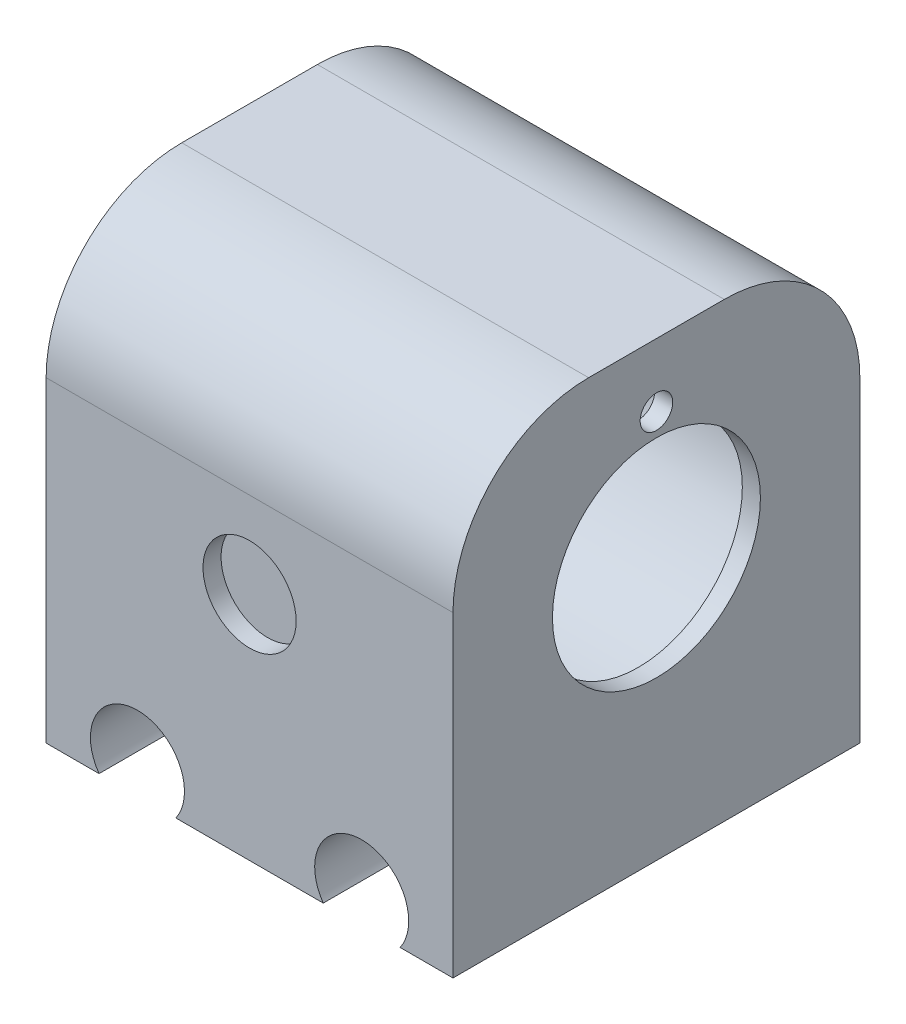
ISO-10303-21;
HEADER;
FILE_DESCRIPTION(('STEP AP214'),'2;1');
FILE_NAME('part.step','',(''),(''),'','','');
FILE_SCHEMA(('AUTOMOTIVE_DESIGN { 1 0 10303 214 1 1 1 1 }'));
ENDSEC;
DATA;
#1=APPLICATION_CONTEXT('core data for automotive mechanical design processes');
#2=APPLICATION_PROTOCOL_DEFINITION('international standard','automotive_design',2000,#1);
#3=PRODUCT_CONTEXT('',#1,'mechanical');
#4=PRODUCT('Part','Part','',(#3));
#5=PRODUCT_RELATED_PRODUCT_CATEGORY('part','',(#4));
#6=PRODUCT_DEFINITION_FORMATION('','',#4);
#7=PRODUCT_DEFINITION_CONTEXT('part definition',#1,'design');
#8=PRODUCT_DEFINITION('design','',#6,#7);
#9=PRODUCT_DEFINITION_SHAPE('','',#8);
#10=(LENGTH_UNIT() NAMED_UNIT(*) SI_UNIT(.MILLI.,.METRE.));
#11=(NAMED_UNIT(*) PLANE_ANGLE_UNIT() SI_UNIT($,.RADIAN.));
#12=(NAMED_UNIT(*) SI_UNIT($,.STERADIAN.) SOLID_ANGLE_UNIT());
#13=UNCERTAINTY_MEASURE_WITH_UNIT(LENGTH_MEASURE(1.E-05),#10,'distance_accuracy_value','');
#14=(GEOMETRIC_REPRESENTATION_CONTEXT(3) GLOBAL_UNCERTAINTY_ASSIGNED_CONTEXT((#13)) GLOBAL_UNIT_ASSIGNED_CONTEXT((#10,
#11,#12)) REPRESENTATION_CONTEXT('',''));
#15=CARTESIAN_POINT('',(0.,0.,0.));
#16=DIRECTION('',(0.,0.,1.));
#17=DIRECTION('',(1.,0.,0.));
#18=AXIS2_PLACEMENT_3D('',#15,#16,#17);
#19=CARTESIAN_POINT('',(30.7366071428572,1.09821428571429,22.5));
#20=DIRECTION('',(-1.,0.,0.));
#21=DIRECTION('',(0.,-1.,0.));
#22=AXIS2_PLACEMENT_3D('',#19,#20,#21);
#23=CYLINDRICAL_SURFACE('',#22,18.375);
#24=CARTESIAN_POINT('',(-14.2633928571429,1.09821428571429,22.5));
#25=DIRECTION('',(-1.,0.,0.));
#26=DIRECTION('',(0.,-1.,0.));
#27=AXIS2_PLACEMENT_3D('',#24,#25,#26);
#28=CIRCLE('',#27,18.375);
#29=CARTESIAN_POINT('',(-14.2633928571429,-17.2767857142857,22.5));
#30=VERTEX_POINT('',#29);
#31=EDGE_CURVE('E202',#30,#30,#28,.T.);
#32=ORIENTED_EDGE('',*,*,#31,.T.);
#33=EDGE_LOOP('',(#32));
#34=FACE_BOUND('',#33,.T.);
#35=CARTESIAN_POINT('',(28.7366071428571,1.09821428571429,22.5));
#36=DIRECTION('',(1.,0.,0.));
#37=DIRECTION('',(0.,1.,0.));
#38=AXIS2_PLACEMENT_3D('',#35,#36,#37);
#39=CIRCLE('',#38,18.375);
#40=CARTESIAN_POINT('',(28.7366071428571,19.4732142857143,22.5));
#41=VERTEX_POINT('',#40);
#42=EDGE_CURVE('E11',#41,#41,#39,.F.);
#43=ORIENTED_EDGE('',*,*,#42,.F.);
#44=EDGE_LOOP('',(#43));
#45=FACE_BOUND('',#44,.T.);
#46=ADVANCED_FACE('F39',(#34,#45),#23,.F.);
#47=CARTESIAN_POINT('',(-14.2633928571429,-27.9017857142857,45.));
#48=DIRECTION('',(0.,1.,0.));
#49=DIRECTION('',(0.,0.,1.));
#50=AXIS2_PLACEMENT_3D('',#47,#48,#49);
#51=PLANE('',#50);
#52=DIRECTION('',(1.,0.,0.));
#53=VECTOR('',#52,1.);
#54=CARTESIAN_POINT('',(-14.2633928571429,-27.9017857142857,0.));
#55=LINE('',#54,#53);
#56=CARTESIAN_POINT('',(-14.2633928571429,-27.9017857142857,0.));
#57=VERTEX_POINT('',#56);
#58=CARTESIAN_POINT('',(-8.41074497346191,-27.9017857142857,0.));
#59=VERTEX_POINT('',#58);
#60=EDGE_CURVE('E144',#57,#59,#55,.T.);
#61=ORIENTED_EDGE('',*,*,#60,.T.);
#62=DIRECTION('',(0.,0.,1.));
#63=VECTOR('',#62,1.);
#64=CARTESIAN_POINT('',(-8.41074497346191,-27.9017857142857,0.));
#65=LINE('',#64,#63);
#66=CARTESIAN_POINT('',(-8.41074497346191,-27.9017857142857,45.));
#67=VERTEX_POINT('',#66);
#68=EDGE_CURVE('E145',#59,#67,#65,.T.);
#69=ORIENTED_EDGE('',*,*,#68,.T.);
#70=DIRECTION('',(1.,0.,0.));
#71=VECTOR('',#70,1.);
#72=CARTESIAN_POINT('',(-14.2633928571429,-27.9017857142857,45.));
#73=LINE('',#72,#71);
#74=CARTESIAN_POINT('',(-14.2633928571429,-27.9017857142857,45.));
#75=VERTEX_POINT('',#74);
#76=EDGE_CURVE('E188',#75,#67,#73,.T.);
#77=ORIENTED_EDGE('',*,*,#76,.F.);
#78=DIRECTION('',(0.,0.,-1.));
#79=VECTOR('',#78,1.);
#80=CARTESIAN_POINT('',(-14.2633928571429,-27.9017857142857,45.));
#81=LINE('',#80,#79);
#82=EDGE_CURVE('E128',#75,#57,#81,.T.);
#83=ORIENTED_EDGE('',*,*,#82,.T.);
#84=EDGE_LOOP('',(#61,#69,#77,#83));
#85=FACE_BOUND('',#84,.T.);
#86=ADVANCED_FACE('F241',(#85),#51,.F.);
#87=CARTESIAN_POINT('',(0.0839592591762011,-27.9017857142857,45.));
#88=VERTEX_POINT('',#87);
#89=CARTESIAN_POINT('',(16.3892550265381,-27.9017857142857,45.));
#90=VERTEX_POINT('',#89);
#91=EDGE_CURVE('E232',#88,#90,#73,.T.);
#92=ORIENTED_EDGE('',*,*,#91,.F.);
#93=DIRECTION('',(0.,0.,1.));
#94=VECTOR('',#93,1.);
#95=CARTESIAN_POINT('',(0.0839592591762002,-27.9017857142857,0.));
#96=LINE('',#95,#94);
#97=CARTESIAN_POINT('',(0.0839592591762011,-27.9017857142857,0.));
#98=VERTEX_POINT('',#97);
#99=EDGE_CURVE('E227',#88,#98,#96,.F.);
#100=ORIENTED_EDGE('',*,*,#99,.T.);
#101=CARTESIAN_POINT('',(16.3892550265381,-27.9017857142857,0.));
#102=VERTEX_POINT('',#101);
#103=EDGE_CURVE('E141',#98,#102,#55,.T.);
#104=ORIENTED_EDGE('',*,*,#103,.T.);
#105=DIRECTION('',(0.,0.,1.));
#106=VECTOR('',#105,1.);
#107=CARTESIAN_POINT('',(16.3892550265381,-27.9017857142857,0.));
#108=LINE('',#107,#106);
#109=EDGE_CURVE('E123',#102,#90,#108,.T.);
#110=ORIENTED_EDGE('',*,*,#109,.T.);
#111=EDGE_LOOP('',(#92,#100,#104,#110));
#112=FACE_BOUND('',#111,.T.);
#113=ADVANCED_FACE('F238',(#112),#51,.F.);
#114=CARTESIAN_POINT('',(-14.2633928571429,22.0982142857143,45.));
#115=DIRECTION('',(1.,0.,0.));
#116=DIRECTION('',(0.,1.,0.));
#117=AXIS2_PLACEMENT_3D('',#114,#115,#116);
#118=PLANE('',#117);
#119=ORIENTED_EDGE('',*,*,#31,.F.);
#120=EDGE_LOOP('',(#119));
#121=FACE_BOUND('',#120,.T.);
#122=DIRECTION('',(0.,-1.,0.));
#123=VECTOR('',#122,1.);
#124=CARTESIAN_POINT('',(-14.2633928571429,22.0982142857143,45.));
#125=LINE('',#124,#123);
#126=CARTESIAN_POINT('',(-14.2633928571429,7.09821428571429,45.));
#127=VERTEX_POINT('',#126);
#128=EDGE_CURVE('E153',#127,#75,#125,.T.);
#129=ORIENTED_EDGE('',*,*,#128,.F.);
#130=CARTESIAN_POINT('',(-14.2633928571429,7.09821428571429,30.));
#131=DIRECTION('',(1.,0.,0.));
#132=DIRECTION('',(0.,1.,0.));
#133=AXIS2_PLACEMENT_3D('',#130,#131,#132);
#134=CIRCLE('',#133,15.);
#135=CARTESIAN_POINT('',(-14.2633928571429,22.0982142857143,30.));
#136=VERTEX_POINT('',#135);
#137=EDGE_CURVE('E167',#127,#136,#134,.F.);
#138=ORIENTED_EDGE('',*,*,#137,.T.);
#139=DIRECTION('',(0.,0.,-1.));
#140=VECTOR('',#139,1.);
#141=CARTESIAN_POINT('',(-14.2633928571429,22.0982142857143,0.));
#142=LINE('',#141,#140);
#143=CARTESIAN_POINT('',(-14.2633928571429,22.0982142857143,15.));
#144=VERTEX_POINT('',#143);
#145=EDGE_CURVE('E195',#136,#144,#142,.T.);
#146=ORIENTED_EDGE('',*,*,#145,.T.);
#147=CARTESIAN_POINT('',(-14.2633928571429,7.09821428571429,15.));
#148=DIRECTION('',(1.,0.,0.));
#149=DIRECTION('',(0.,1.,0.));
#150=AXIS2_PLACEMENT_3D('',#147,#148,#149);
#151=CIRCLE('',#150,15.);
#152=CARTESIAN_POINT('',(-14.2633928571429,7.09821428571429,0.));
#153=VERTEX_POINT('',#152);
#154=EDGE_CURVE('E165',#144,#153,#151,.F.);
#155=ORIENTED_EDGE('',*,*,#154,.T.);
#156=DIRECTION('',(0.,-1.,0.));
#157=VECTOR('',#156,1.);
#158=CARTESIAN_POINT('',(-14.2633928571429,22.0982142857143,0.));
#159=LINE('',#158,#157);
#160=EDGE_CURVE('E142',#153,#57,#159,.T.);
#161=ORIENTED_EDGE('',*,*,#160,.T.);
#162=ORIENTED_EDGE('',*,*,#82,.F.);
#163=EDGE_LOOP('',(#129,#138,#146,#155,#161,#162));
#164=FACE_BOUND('',#163,.T.);
#165=ADVANCED_FACE('F194',(#121,#164),#118,.F.);
#166=CARTESIAN_POINT('',(24.8839592591762,-27.9017857142857,45.));
#167=VERTEX_POINT('',#166);
#168=CARTESIAN_POINT('',(30.7366071428571,-27.9017857142857,45.));
#169=VERTEX_POINT('',#168);
#170=EDGE_CURVE('E136',#167,#169,#73,.T.);
#171=ORIENTED_EDGE('',*,*,#170,.F.);
#172=DIRECTION('',(0.,0.,1.));
#173=VECTOR('',#172,1.);
#174=CARTESIAN_POINT('',(24.8839592591762,-27.9017857142857,0.));
#175=LINE('',#174,#173);
#176=CARTESIAN_POINT('',(24.8839592591762,-27.9017857142857,0.));
#177=VERTEX_POINT('',#176);
#178=EDGE_CURVE('E120',#167,#177,#175,.F.);
#179=ORIENTED_EDGE('',*,*,#178,.T.);
#180=CARTESIAN_POINT('',(30.7366071428571,-27.9017857142857,0.));
#181=VERTEX_POINT('',#180);
#182=EDGE_CURVE('E134',#177,#181,#55,.T.);
#183=ORIENTED_EDGE('',*,*,#182,.T.);
#184=DIRECTION('',(0.,0.,-1.));
#185=VECTOR('',#184,1.);
#186=CARTESIAN_POINT('',(30.7366071428571,-27.9017857142857,45.));
#187=LINE('',#186,#185);
#188=EDGE_CURVE('E156',#169,#181,#187,.T.);
#189=ORIENTED_EDGE('',*,*,#188,.F.);
#190=EDGE_LOOP('',(#171,#179,#183,#189));
#191=FACE_BOUND('',#190,.T.);
#192=ADVANCED_FACE('F132',(#191),#51,.F.);
#193=CARTESIAN_POINT('',(30.7366071428571,22.0982142857143,45.));
#194=DIRECTION('',(-1.,0.,0.));
#195=DIRECTION('',(0.,-1.,0.));
#196=AXIS2_PLACEMENT_3D('',#193,#194,#195);
#197=PLANE('',#196);
#198=CARTESIAN_POINT('',(30.7366071428571,15.0982142857143,22.5));
#199=DIRECTION('',(1.,0.,0.));
#200=DIRECTION('',(0.,1.,0.));
#201=AXIS2_PLACEMENT_3D('',#198,#199,#200);
#202=CIRCLE('',#201,1.8);
#203=CARTESIAN_POINT('',(30.7366071428571,16.8982142857143,22.5));
#204=VERTEX_POINT('',#203);
#205=EDGE_CURVE('E428',#204,#204,#202,.T.);
#206=ORIENTED_EDGE('',*,*,#205,.F.);
#207=EDGE_LOOP('',(#206));
#208=FACE_BOUND('',#207,.T.);
#209=CARTESIAN_POINT('',(30.7366071428571,1.09821428571429,22.5));
#210=DIRECTION('',(1.,0.,0.));
#211=DIRECTION('',(0.,1.,0.));
#212=AXIS2_PLACEMENT_3D('',#209,#210,#211);
#213=CIRCLE('',#212,11.5);
#214=CARTESIAN_POINT('',(30.7366071428571,12.5982142857143,22.5));
#215=VERTEX_POINT('',#214);
#216=EDGE_CURVE('E205',#215,#215,#213,.T.);
#217=ORIENTED_EDGE('',*,*,#216,.F.);
#218=EDGE_LOOP('',(#217));
#219=FACE_BOUND('',#218,.T.);
#220=DIRECTION('',(0.,0.,-1.));
#221=VECTOR('',#220,1.);
#222=CARTESIAN_POINT('',(30.7366071428571,22.0982142857143,0.));
#223=LINE('',#222,#221);
#224=CARTESIAN_POINT('',(30.7366071428571,22.0982142857143,30.));
#225=VERTEX_POINT('',#224);
#226=CARTESIAN_POINT('',(30.7366071428571,22.0982142857143,15.));
#227=VERTEX_POINT('',#226);
#228=EDGE_CURVE('E180',#225,#227,#223,.T.);
#229=ORIENTED_EDGE('',*,*,#228,.F.);
#230=CARTESIAN_POINT('',(30.7366071428571,7.0982142857143,30.));
#231=DIRECTION('',(-1.,0.,0.));
#232=DIRECTION('',(0.,-1.,0.));
#233=AXIS2_PLACEMENT_3D('',#230,#231,#232);
#234=CIRCLE('',#233,15.);
#235=CARTESIAN_POINT('',(30.7366071428571,7.09821428571429,45.));
#236=VERTEX_POINT('',#235);
#237=EDGE_CURVE('E175',#225,#236,#234,.F.);
#238=ORIENTED_EDGE('',*,*,#237,.T.);
#239=DIRECTION('',(0.,1.,0.));
#240=VECTOR('',#239,1.);
#241=CARTESIAN_POINT('',(30.7366071428571,22.0982142857143,45.));
#242=LINE('',#241,#240);
#243=EDGE_CURVE('E158',#169,#236,#242,.T.);
#244=ORIENTED_EDGE('',*,*,#243,.F.);
#245=ORIENTED_EDGE('',*,*,#188,.T.);
#246=DIRECTION('',(0.,1.,0.));
#247=VECTOR('',#246,1.);
#248=CARTESIAN_POINT('',(30.7366071428571,22.0982142857143,0.));
#249=LINE('',#248,#247);
#250=CARTESIAN_POINT('',(30.7366071428571,7.0982142857143,0.));
#251=VERTEX_POINT('',#250);
#252=EDGE_CURVE('E140',#181,#251,#249,.T.);
#253=ORIENTED_EDGE('',*,*,#252,.T.);
#254=CARTESIAN_POINT('',(30.7366071428571,7.0982142857143,15.));
#255=DIRECTION('',(-1.,0.,0.));
#256=DIRECTION('',(0.,-1.,0.));
#257=AXIS2_PLACEMENT_3D('',#254,#255,#256);
#258=CIRCLE('',#257,15.);
#259=EDGE_CURVE('E60',#251,#227,#258,.F.);
#260=ORIENTED_EDGE('',*,*,#259,.T.);
#261=EDGE_LOOP('',(#229,#238,#244,#245,#253,#260));
#262=FACE_BOUND('',#261,.T.);
#263=ADVANCED_FACE('F179',(#208,#219,#262),#197,.F.);
#264=CARTESIAN_POINT('',(0.,0.,45.));
#265=DIRECTION('',(0.,0.,1.));
#266=DIRECTION('',(1.,0.,0.));
#267=AXIS2_PLACEMENT_3D('',#264,#265,#266);
#268=PLANE('',#267);
#269=ORIENTED_EDGE('',*,*,#243,.T.);
#270=DIRECTION('',(-1.,0.,0.));
#271=VECTOR('',#270,1.);
#272=CARTESIAN_POINT('',(0.,7.09821428571429,45.));
#273=LINE('',#272,#271);
#274=EDGE_CURVE('E162',#236,#127,#273,.T.);
#275=ORIENTED_EDGE('',*,*,#274,.T.);
#276=ORIENTED_EDGE('',*,*,#128,.T.);
#277=ORIENTED_EDGE('',*,*,#76,.T.);
#278=CARTESIAN_POINT('',(-4.16339285714286,-24.9017857142857,45.));
#279=DIRECTION('',(0.,0.,1.));
#280=DIRECTION('',(1.,0.,0.));
#281=AXIS2_PLACEMENT_3D('',#278,#279,#280);
#282=CIRCLE('',#281,5.2);
#283=EDGE_CURVE('E137',#88,#67,#282,.T.);
#284=ORIENTED_EDGE('',*,*,#283,.F.);
#285=ORIENTED_EDGE('',*,*,#91,.T.);
#286=CARTESIAN_POINT('',(20.6366071428571,-24.9017857142857,45.));
#287=DIRECTION('',(0.,0.,1.));
#288=DIRECTION('',(1.,0.,0.));
#289=AXIS2_PLACEMENT_3D('',#286,#287,#288);
#290=CIRCLE('',#289,5.2);
#291=EDGE_CURVE('E221',#167,#90,#290,.T.);
#292=ORIENTED_EDGE('',*,*,#291,.F.);
#293=ORIENTED_EDGE('',*,*,#170,.T.);
#294=EDGE_LOOP('',(#269,#275,#276,#277,#284,#285,#292,#293));
#295=FACE_BOUND('',#294,.T.);
#296=CARTESIAN_POINT('',(8.23660714285715,-2.40178571428571,45.));
#297=DIRECTION('',(0.,0.,1.));
#298=DIRECTION('',(1.,0.,0.));
#299=AXIS2_PLACEMENT_3D('',#296,#297,#298);
#300=CIRCLE('',#299,5.15);
#301=CARTESIAN_POINT('',(13.3866071428572,-2.40178571428571,45.));
#302=VERTEX_POINT('',#301);
#303=EDGE_CURVE('E215',#302,#302,#300,.T.);
#304=ORIENTED_EDGE('',*,*,#303,.F.);
#305=EDGE_LOOP('',(#304));
#306=FACE_BOUND('',#305,.T.);
#307=ADVANCED_FACE('F185',(#295,#306),#268,.T.);
#308=CARTESIAN_POINT('',(0.,0.,0.));
#309=DIRECTION('',(0.,0.,1.));
#310=DIRECTION('',(1.,0.,0.));
#311=AXIS2_PLACEMENT_3D('',#308,#309,#310);
#312=PLANE('',#311);
#313=CARTESIAN_POINT('',(8.23660714285714,-2.40178571428571,0.));
#314=DIRECTION('',(0.,0.,-1.));
#315=DIRECTION('',(-1.,0.,0.));
#316=AXIS2_PLACEMENT_3D('',#313,#314,#315);
#317=CIRCLE('',#316,5.15);
#318=CARTESIAN_POINT('',(3.08660714285714,-2.40178571428571,0.));
#319=VERTEX_POINT('',#318);
#320=EDGE_CURVE('E211',#319,#319,#317,.T.);
#321=ORIENTED_EDGE('',*,*,#320,.F.);
#322=EDGE_LOOP('',(#321));
#323=FACE_BOUND('',#322,.T.);
#324=ORIENTED_EDGE('',*,*,#160,.F.);
#325=DIRECTION('',(-1.,0.,0.));
#326=VECTOR('',#325,1.);
#327=CARTESIAN_POINT('',(30.7366071428571,7.0982142857143,0.));
#328=LINE('',#327,#326);
#329=EDGE_CURVE('E47',#153,#251,#328,.F.);
#330=ORIENTED_EDGE('',*,*,#329,.T.);
#331=ORIENTED_EDGE('',*,*,#252,.F.);
#332=ORIENTED_EDGE('',*,*,#182,.F.);
#333=CARTESIAN_POINT('',(20.6366071428571,-24.9017857142857,0.));
#334=DIRECTION('',(0.,0.,1.));
#335=DIRECTION('',(1.,0.,0.));
#336=AXIS2_PLACEMENT_3D('',#333,#334,#335);
#337=CIRCLE('',#336,5.2);
#338=EDGE_CURVE('E117',#177,#102,#337,.T.);
#339=ORIENTED_EDGE('',*,*,#338,.T.);
#340=ORIENTED_EDGE('',*,*,#103,.F.);
#341=CARTESIAN_POINT('',(-4.16339285714286,-24.9017857142857,0.));
#342=DIRECTION('',(0.,0.,1.));
#343=DIRECTION('',(1.,0.,0.));
#344=AXIS2_PLACEMENT_3D('',#341,#342,#343);
#345=CIRCLE('',#344,5.2);
#346=EDGE_CURVE('E127',#98,#59,#345,.T.);
#347=ORIENTED_EDGE('',*,*,#346,.T.);
#348=ORIENTED_EDGE('',*,*,#60,.F.);
#349=EDGE_LOOP('',(#324,#330,#331,#332,#339,#340,#347,#348));
#350=FACE_BOUND('',#349,.T.);
#351=ADVANCED_FACE('F139',(#323,#350),#312,.F.);
#352=CARTESIAN_POINT('',(20.6366071428571,-24.9017857142857,0.));
#353=DIRECTION('',(0.,0.,1.));
#354=DIRECTION('',(1.,0.,0.));
#355=AXIS2_PLACEMENT_3D('',#352,#353,#354);
#356=CYLINDRICAL_SURFACE('',#355,5.2);
#357=ORIENTED_EDGE('',*,*,#338,.F.);
#358=ORIENTED_EDGE('',*,*,#178,.F.);
#359=ORIENTED_EDGE('',*,*,#291,.T.);
#360=ORIENTED_EDGE('',*,*,#109,.F.);
#361=EDGE_LOOP('',(#357,#358,#359,#360));
#362=FACE_BOUND('',#361,.T.);
#363=ADVANCED_FACE('F119',(#362),#356,.F.);
#364=CARTESIAN_POINT('',(-4.16339285714286,-24.9017857142857,0.));
#365=DIRECTION('',(0.,0.,1.));
#366=DIRECTION('',(1.,0.,0.));
#367=AXIS2_PLACEMENT_3D('',#364,#365,#366);
#368=CYLINDRICAL_SURFACE('',#367,5.2);
#369=ORIENTED_EDGE('',*,*,#346,.F.);
#370=ORIENTED_EDGE('',*,*,#99,.F.);
#371=ORIENTED_EDGE('',*,*,#283,.T.);
#372=ORIENTED_EDGE('',*,*,#68,.F.);
#373=EDGE_LOOP('',(#369,#370,#371,#372));
#374=FACE_BOUND('',#373,.T.);
#375=ADVANCED_FACE('F240',(#374),#368,.F.);
#376=CARTESIAN_POINT('',(8.23660714285715,-2.40178571428571,43.));
#377=DIRECTION('',(0.,0.,1.));
#378=DIRECTION('',(1.,0.,0.));
#379=AXIS2_PLACEMENT_3D('',#376,#377,#378);
#380=CYLINDRICAL_SURFACE('',#379,5.15);
#381=CARTESIAN_POINT('',(8.23660714285715,-2.40178571428571,43.));
#382=DIRECTION('',(0.,0.,1.));
#383=DIRECTION('',(1.,0.,0.));
#384=AXIS2_PLACEMENT_3D('',#381,#382,#383);
#385=CIRCLE('',#384,5.15);
#386=CARTESIAN_POINT('',(13.3866071428572,-2.40178571428571,43.));
#387=VERTEX_POINT('',#386);
#388=EDGE_CURVE('E218',#387,#387,#385,.T.);
#389=ORIENTED_EDGE('',*,*,#388,.F.);
#390=EDGE_LOOP('',(#389));
#391=FACE_BOUND('',#390,.T.);
#392=ORIENTED_EDGE('',*,*,#303,.T.);
#393=EDGE_LOOP('',(#392));
#394=FACE_BOUND('',#393,.T.);
#395=ADVANCED_FACE('F274',(#391,#394),#380,.F.);
#396=CARTESIAN_POINT('',(8.23660714285715,-2.40178571428571,43.));
#397=DIRECTION('',(0.,0.,1.));
#398=DIRECTION('',(1.,0.,0.));
#399=AXIS2_PLACEMENT_3D('',#396,#397,#398);
#400=PLANE('',#399);
#401=ORIENTED_EDGE('',*,*,#388,.T.);
#402=EDGE_LOOP('',(#401));
#403=FACE_BOUND('',#402,.T.);
#404=ADVANCED_FACE('F270',(#403),#400,.T.);
#405=CARTESIAN_POINT('',(8.23660714285714,-2.40178571428571,2.));
#406=DIRECTION('',(0.,0.,-1.));
#407=DIRECTION('',(-1.,0.,0.));
#408=AXIS2_PLACEMENT_3D('',#405,#406,#407);
#409=CYLINDRICAL_SURFACE('',#408,5.15);
#410=CARTESIAN_POINT('',(8.23660714285714,-2.40178571428571,2.));
#411=DIRECTION('',(0.,0.,-1.));
#412=DIRECTION('',(-1.,0.,0.));
#413=AXIS2_PLACEMENT_3D('',#410,#411,#412);
#414=CIRCLE('',#413,5.15);
#415=CARTESIAN_POINT('',(3.08660714285714,-2.40178571428571,2.));
#416=VERTEX_POINT('',#415);
#417=EDGE_CURVE('E212',#416,#416,#414,.T.);
#418=ORIENTED_EDGE('',*,*,#417,.F.);
#419=EDGE_LOOP('',(#418));
#420=FACE_BOUND('',#419,.T.);
#421=ORIENTED_EDGE('',*,*,#320,.T.);
#422=EDGE_LOOP('',(#421));
#423=FACE_BOUND('',#422,.T.);
#424=ADVANCED_FACE('F266',(#420,#423),#409,.F.);
#425=CARTESIAN_POINT('',(8.23660714285714,-2.40178571428571,2.));
#426=DIRECTION('',(0.,0.,-1.));
#427=DIRECTION('',(-1.,0.,0.));
#428=AXIS2_PLACEMENT_3D('',#425,#426,#427);
#429=PLANE('',#428);
#430=ORIENTED_EDGE('',*,*,#417,.T.);
#431=EDGE_LOOP('',(#430));
#432=FACE_BOUND('',#431,.T.);
#433=ADVANCED_FACE('F263',(#432),#429,.T.);
#434=CARTESIAN_POINT('',(30.7366071428571,22.0982142857143,0.));
#435=DIRECTION('',(0.,1.,0.));
#436=DIRECTION('',(-1.,0.,0.));
#437=AXIS2_PLACEMENT_3D('',#434,#435,#436);
#438=PLANE('',#437);
#439=ORIENTED_EDGE('',*,*,#145,.F.);
#440=DIRECTION('',(-1.,0.,0.));
#441=VECTOR('',#440,1.);
#442=CARTESIAN_POINT('',(30.7366071428571,22.0982142857143,30.));
#443=LINE('',#442,#441);
#444=EDGE_CURVE('E172',#136,#225,#443,.F.);
#445=ORIENTED_EDGE('',*,*,#444,.T.);
#446=ORIENTED_EDGE('',*,*,#228,.T.);
#447=DIRECTION('',(-1.,0.,0.));
#448=VECTOR('',#447,1.);
#449=CARTESIAN_POINT('',(-14.2633928571429,22.0982142857143,15.));
#450=LINE('',#449,#448);
#451=EDGE_CURVE('E169',#227,#144,#450,.T.);
#452=ORIENTED_EDGE('',*,*,#451,.T.);
#453=EDGE_LOOP('',(#439,#445,#446,#452));
#454=FACE_BOUND('',#453,.T.);
#455=ADVANCED_FACE('F198',(#454),#438,.T.);
#456=CARTESIAN_POINT('',(0.,7.09821428571429,30.));
#457=DIRECTION('',(-1.,0.,0.));
#458=DIRECTION('',(0.,-1.,0.));
#459=AXIS2_PLACEMENT_3D('',#456,#457,#458);
#460=CYLINDRICAL_SURFACE('',#459,15.);
#461=ORIENTED_EDGE('',*,*,#237,.F.);
#462=ORIENTED_EDGE('',*,*,#444,.F.);
#463=ORIENTED_EDGE('',*,*,#137,.F.);
#464=ORIENTED_EDGE('',*,*,#274,.F.);
#465=EDGE_LOOP('',(#461,#462,#463,#464));
#466=FACE_BOUND('',#465,.T.);
#467=ADVANCED_FACE('F190',(#466),#460,.T.);
#468=CARTESIAN_POINT('',(30.7366071428571,7.0982142857143,15.));
#469=DIRECTION('',(1.,0.,0.));
#470=DIRECTION('',(0.,1.,0.));
#471=AXIS2_PLACEMENT_3D('',#468,#469,#470);
#472=CYLINDRICAL_SURFACE('',#471,15.);
#473=ORIENTED_EDGE('',*,*,#259,.F.);
#474=ORIENTED_EDGE('',*,*,#329,.F.);
#475=ORIENTED_EDGE('',*,*,#154,.F.);
#476=ORIENTED_EDGE('',*,*,#451,.F.);
#477=EDGE_LOOP('',(#473,#474,#475,#476));
#478=FACE_BOUND('',#477,.T.);
#479=ADVANCED_FACE('F41',(#478),#472,.T.);
#480=CARTESIAN_POINT('',(28.7366071428571,1.09821428571429,22.5));
#481=DIRECTION('',(1.,0.,0.));
#482=DIRECTION('',(0.,1.,0.));
#483=AXIS2_PLACEMENT_3D('',#480,#481,#482);
#484=PLANE('',#483);
#485=CARTESIAN_POINT('',(28.7366071428571,15.0982142857143,22.5));
#486=DIRECTION('',(1.,0.,0.));
#487=DIRECTION('',(0.,1.,0.));
#488=AXIS2_PLACEMENT_3D('',#485,#486,#487);
#489=CIRCLE('',#488,1.8);
#490=CARTESIAN_POINT('',(28.7366071428571,16.8982142857143,22.5));
#491=VERTEX_POINT('',#490);
#492=EDGE_CURVE('E425',#491,#491,#489,.T.);
#493=ORIENTED_EDGE('',*,*,#492,.T.);
#494=EDGE_LOOP('',(#493));
#495=FACE_BOUND('',#494,.T.);
#496=CARTESIAN_POINT('',(28.7366071428571,1.09821428571429,22.5));
#497=DIRECTION('',(1.,0.,0.));
#498=DIRECTION('',(0.,1.,0.));
#499=AXIS2_PLACEMENT_3D('',#496,#497,#498);
#500=CIRCLE('',#499,11.5);
#501=CARTESIAN_POINT('',(28.7366071428571,12.5982142857143,22.5));
#502=VERTEX_POINT('',#501);
#503=EDGE_CURVE('E200',#502,#502,#500,.T.);
#504=ORIENTED_EDGE('',*,*,#503,.T.);
#505=EDGE_LOOP('',(#504));
#506=FACE_BOUND('',#505,.T.);
#507=ORIENTED_EDGE('',*,*,#42,.T.);
#508=EDGE_LOOP('',(#507));
#509=FACE_BOUND('',#508,.T.);
#510=ADVANCED_FACE('F244',(#495,#506,#509),#484,.F.);
#511=CARTESIAN_POINT('',(28.7366071428571,1.09821428571429,22.5));
#512=DIRECTION('',(1.,0.,0.));
#513=DIRECTION('',(0.,1.,0.));
#514=AXIS2_PLACEMENT_3D('',#511,#512,#513);
#515=CYLINDRICAL_SURFACE('',#514,11.5);
#516=ORIENTED_EDGE('',*,*,#503,.F.);
#517=EDGE_LOOP('',(#516));
#518=FACE_BOUND('',#517,.T.);
#519=ORIENTED_EDGE('',*,*,#216,.T.);
#520=EDGE_LOOP('',(#519));
#521=FACE_BOUND('',#520,.T.);
#522=ADVANCED_FACE('F250',(#518,#521),#515,.F.);
#523=CARTESIAN_POINT('',(28.7366071428571,15.0982142857143,22.5));
#524=DIRECTION('',(1.,0.,0.));
#525=DIRECTION('',(0.,1.,0.));
#526=AXIS2_PLACEMENT_3D('',#523,#524,#525);
#527=CYLINDRICAL_SURFACE('',#526,1.8);
#528=ORIENTED_EDGE('',*,*,#492,.F.);
#529=EDGE_LOOP('',(#528));
#530=FACE_BOUND('',#529,.T.);
#531=ORIENTED_EDGE('',*,*,#205,.T.);
#532=EDGE_LOOP('',(#531));
#533=FACE_BOUND('',#532,.T.);
#534=ADVANCED_FACE('F406',(#530,#533),#527,.F.);
#535=CLOSED_SHELL('',(#46,#86,#113,#165,#192,#263,#307,#351,#363,#375,#395,#404,#424,#433,#455,
#467,#479,#510,#522,#534));
#536=MANIFOLD_SOLID_BREP('B2',#535);
#537=ADVANCED_BREP_SHAPE_REPRESENTATION('',(#18,#536),#14);
#538=SHAPE_DEFINITION_REPRESENTATION(#9,#537);
ENDSEC;
END-ISO-10303-21;
